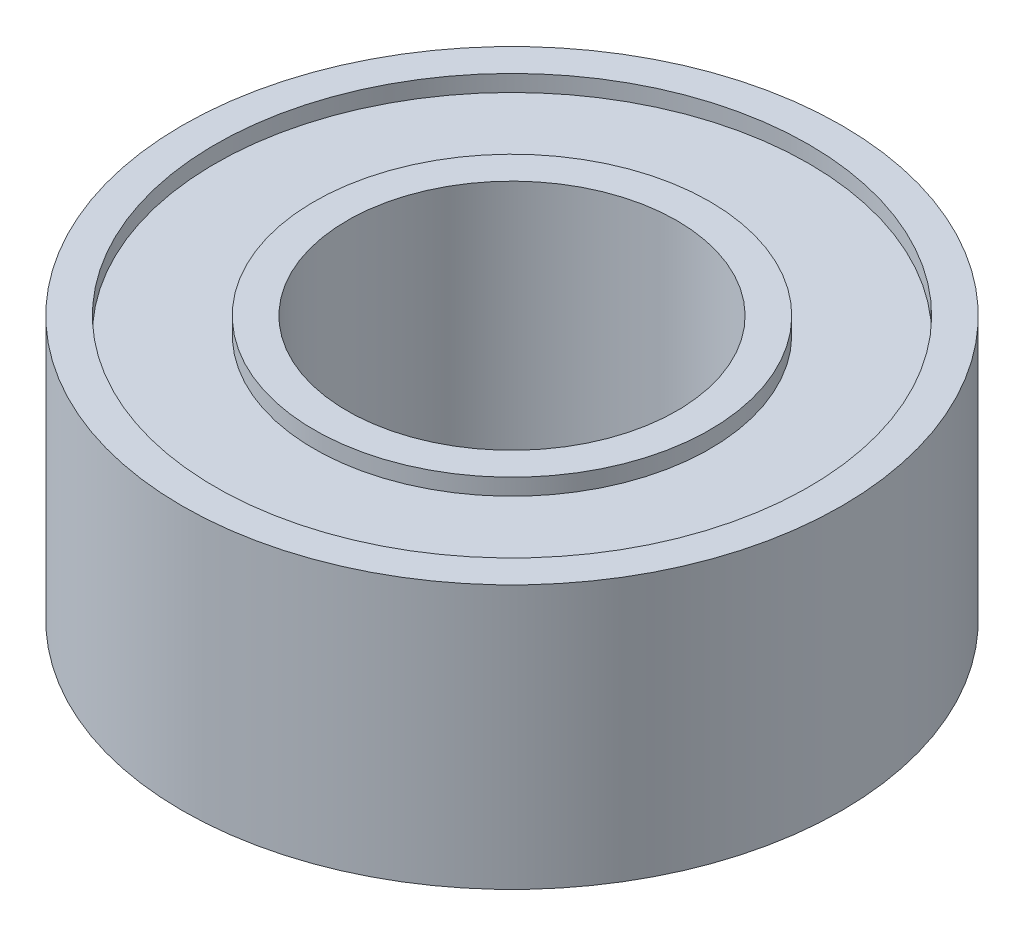
ISO-10303-21;
HEADER;
FILE_DESCRIPTION(('STEP AP214'),'2;1');
FILE_NAME('part.step','',(''),(''),'','','');
FILE_SCHEMA(('AUTOMOTIVE_DESIGN { 1 0 10303 214 1 1 1 1 }'));
ENDSEC;
DATA;
#1=APPLICATION_CONTEXT('core data for automotive mechanical design processes');
#2=APPLICATION_PROTOCOL_DEFINITION('international standard','automotive_design',2000,#1);
#3=PRODUCT_CONTEXT('',#1,'mechanical');
#4=PRODUCT('Part','Part','',(#3));
#5=PRODUCT_RELATED_PRODUCT_CATEGORY('part','',(#4));
#6=PRODUCT_DEFINITION_FORMATION('','',#4);
#7=PRODUCT_DEFINITION_CONTEXT('part definition',#1,'design');
#8=PRODUCT_DEFINITION('design','',#6,#7);
#9=PRODUCT_DEFINITION_SHAPE('','',#8);
#10=(LENGTH_UNIT() NAMED_UNIT(*) SI_UNIT(.MILLI.,.METRE.));
#11=(NAMED_UNIT(*) PLANE_ANGLE_UNIT() SI_UNIT($,.RADIAN.));
#12=(NAMED_UNIT(*) SI_UNIT($,.STERADIAN.) SOLID_ANGLE_UNIT());
#13=UNCERTAINTY_MEASURE_WITH_UNIT(LENGTH_MEASURE(1.E-05),#10,'distance_accuracy_value','');
#14=(GEOMETRIC_REPRESENTATION_CONTEXT(3) GLOBAL_UNCERTAINTY_ASSIGNED_CONTEXT((#13)) GLOBAL_UNIT_ASSIGNED_CONTEXT((#10,
#11,#12)) REPRESENTATION_CONTEXT('',''));
#15=CARTESIAN_POINT('',(0.,0.,0.));
#16=DIRECTION('',(0.,0.,1.));
#17=DIRECTION('',(1.,0.,0.));
#18=AXIS2_PLACEMENT_3D('',#15,#16,#17);
#19=CARTESIAN_POINT('',(0.,-2.,0.));
#20=DIRECTION('',(0.,1.,0.));
#21=DIRECTION('',(0.,0.,-1.));
#22=AXIS2_PLACEMENT_3D('',#19,#20,#21);
#23=PLANE('',#22);
#24=CARTESIAN_POINT('',(0.,-2.,0.));
#25=DIRECTION('',(0.,-1.,0.));
#26=DIRECTION('',(0.,0.,-1.));
#27=AXIS2_PLACEMENT_3D('',#24,#25,#26);
#28=CIRCLE('',#27,2.5);
#29=CARTESIAN_POINT('',(0.,-2.,-2.5));
#30=VERTEX_POINT('',#29);
#31=EDGE_CURVE('E48',#30,#30,#28,.T.);
#32=ORIENTED_EDGE('',*,*,#31,.F.);
#33=EDGE_LOOP('',(#32));
#34=FACE_BOUND('',#33,.T.);
#35=CARTESIAN_POINT('',(0.,-2.,0.));
#36=DIRECTION('',(0.,-1.,0.));
#37=DIRECTION('',(0.,0.,-1.));
#38=AXIS2_PLACEMENT_3D('',#35,#36,#37);
#39=CIRCLE('',#38,3.);
#40=CARTESIAN_POINT('',(0.,-2.,-3.));
#41=VERTEX_POINT('',#40);
#42=EDGE_CURVE('E72',#41,#41,#39,.T.);
#43=ORIENTED_EDGE('',*,*,#42,.T.);
#44=EDGE_LOOP('',(#43));
#45=FACE_BOUND('',#44,.T.);
#46=ADVANCED_FACE('F35',(#34,#45),#23,.F.);
#47=CARTESIAN_POINT('',(0.,2.,0.));
#48=DIRECTION('',(0.,1.,0.));
#49=DIRECTION('',(0.,0.,-1.));
#50=AXIS2_PLACEMENT_3D('',#47,#48,#49);
#51=PLANE('',#50);
#52=CARTESIAN_POINT('',(0.,2.,0.));
#53=DIRECTION('',(0.,-1.,0.));
#54=DIRECTION('',(0.,0.,-1.));
#55=AXIS2_PLACEMENT_3D('',#52,#53,#54);
#56=CIRCLE('',#55,2.5);
#57=CARTESIAN_POINT('',(0.,2.,-2.5));
#58=VERTEX_POINT('',#57);
#59=EDGE_CURVE('E46',#58,#58,#56,.T.);
#60=ORIENTED_EDGE('',*,*,#59,.T.);
#61=EDGE_LOOP('',(#60));
#62=FACE_BOUND('',#61,.T.);
#63=CARTESIAN_POINT('',(0.,2.,0.));
#64=DIRECTION('',(0.,-1.,0.));
#65=DIRECTION('',(0.,0.,-1.));
#66=AXIS2_PLACEMENT_3D('',#63,#64,#65);
#67=CIRCLE('',#66,3.);
#68=CARTESIAN_POINT('',(0.,2.,-3.));
#69=VERTEX_POINT('',#68);
#70=EDGE_CURVE('E60',#69,#69,#67,.T.);
#71=ORIENTED_EDGE('',*,*,#70,.F.);
#72=EDGE_LOOP('',(#71));
#73=FACE_BOUND('',#72,.T.);
#74=ADVANCED_FACE('F98',(#62,#73),#51,.T.);
#75=CARTESIAN_POINT('',(0.,2.,0.));
#76=DIRECTION('',(0.,-1.,0.));
#77=DIRECTION('',(0.,0.,-1.));
#78=AXIS2_PLACEMENT_3D('',#75,#76,#77);
#79=CIRCLE('',#78,4.5);
#80=CARTESIAN_POINT('',(0.,2.,-4.5));
#81=VERTEX_POINT('',#80);
#82=EDGE_CURVE('E54',#81,#81,#79,.T.);
#83=ORIENTED_EDGE('',*,*,#82,.T.);
#84=EDGE_LOOP('',(#83));
#85=FACE_BOUND('',#84,.T.);
#86=CARTESIAN_POINT('',(0.,2.,0.));
#87=DIRECTION('',(0.,-1.,0.));
#88=DIRECTION('',(0.,0.,-1.));
#89=AXIS2_PLACEMENT_3D('',#86,#87,#88);
#90=CIRCLE('',#89,5.);
#91=CARTESIAN_POINT('',(0.,2.,-5.));
#92=VERTEX_POINT('',#91);
#93=EDGE_CURVE('E10',#92,#92,#90,.T.);
#94=ORIENTED_EDGE('',*,*,#93,.F.);
#95=EDGE_LOOP('',(#94));
#96=FACE_BOUND('',#95,.T.);
#97=ADVANCED_FACE('F104',(#85,#96),#51,.T.);
#98=CARTESIAN_POINT('',(0.,-2.,0.));
#99=DIRECTION('',(0.,-1.,0.));
#100=DIRECTION('',(0.,0.,-1.));
#101=AXIS2_PLACEMENT_3D('',#98,#99,#100);
#102=CIRCLE('',#101,4.5);
#103=CARTESIAN_POINT('',(0.,-2.,-4.5));
#104=VERTEX_POINT('',#103);
#105=EDGE_CURVE('E66',#104,#104,#102,.T.);
#106=ORIENTED_EDGE('',*,*,#105,.F.);
#107=EDGE_LOOP('',(#106));
#108=FACE_BOUND('',#107,.T.);
#109=CARTESIAN_POINT('',(0.,-2.,0.));
#110=DIRECTION('',(0.,-1.,0.));
#111=DIRECTION('',(0.,0.,-1.));
#112=AXIS2_PLACEMENT_3D('',#109,#110,#111);
#113=CIRCLE('',#112,5.);
#114=CARTESIAN_POINT('',(0.,-2.,-5.));
#115=VERTEX_POINT('',#114);
#116=EDGE_CURVE('E39',#115,#115,#113,.T.);
#117=ORIENTED_EDGE('',*,*,#116,.T.);
#118=EDGE_LOOP('',(#117));
#119=FACE_BOUND('',#118,.T.);
#120=ADVANCED_FACE('F100',(#108,#119),#23,.F.);
#121=CARTESIAN_POINT('',(0.,2.,0.));
#122=DIRECTION('',(0.,-1.,0.));
#123=DIRECTION('',(0.,0.,1.));
#124=AXIS2_PLACEMENT_3D('',#121,#122,#123);
#125=CYLINDRICAL_SURFACE('',#124,5.);
#126=ORIENTED_EDGE('',*,*,#93,.T.);
#127=EDGE_LOOP('',(#126));
#128=FACE_BOUND('',#127,.T.);
#129=ORIENTED_EDGE('',*,*,#116,.F.);
#130=EDGE_LOOP('',(#129));
#131=FACE_BOUND('',#130,.T.);
#132=ADVANCED_FACE('F37',(#128,#131),#125,.T.);
#133=CARTESIAN_POINT('',(0.,2.,0.));
#134=DIRECTION('',(0.,-1.,0.));
#135=DIRECTION('',(0.,0.,1.));
#136=AXIS2_PLACEMENT_3D('',#133,#134,#135);
#137=CYLINDRICAL_SURFACE('',#136,2.5);
#138=ORIENTED_EDGE('',*,*,#59,.F.);
#139=EDGE_LOOP('',(#138));
#140=FACE_BOUND('',#139,.T.);
#141=ORIENTED_EDGE('',*,*,#31,.T.);
#142=EDGE_LOOP('',(#141));
#143=FACE_BOUND('',#142,.T.);
#144=ADVANCED_FACE('F115',(#140,#143),#137,.F.);
#145=CARTESIAN_POINT('',(0.,1.75,0.));
#146=DIRECTION('',(0.,1.,0.));
#147=DIRECTION('',(0.,0.,-1.));
#148=AXIS2_PLACEMENT_3D('',#145,#146,#147);
#149=CYLINDRICAL_SURFACE('',#148,4.5);
#150=CARTESIAN_POINT('',(0.,1.75,0.));
#151=DIRECTION('',(0.,-1.,0.));
#152=DIRECTION('',(0.,0.,-1.));
#153=AXIS2_PLACEMENT_3D('',#150,#151,#152);
#154=CIRCLE('',#153,4.5);
#155=CARTESIAN_POINT('',(0.,1.75,-4.5));
#156=VERTEX_POINT('',#155);
#157=EDGE_CURVE('E51',#156,#156,#154,.T.);
#158=ORIENTED_EDGE('',*,*,#157,.T.);
#159=EDGE_LOOP('',(#158));
#160=FACE_BOUND('',#159,.T.);
#161=ORIENTED_EDGE('',*,*,#82,.F.);
#162=EDGE_LOOP('',(#161));
#163=FACE_BOUND('',#162,.T.);
#164=ADVANCED_FACE('F128',(#160,#163),#149,.F.);
#165=CARTESIAN_POINT('',(0.,1.75,0.));
#166=DIRECTION('',(0.,1.,0.));
#167=DIRECTION('',(0.,0.,-1.));
#168=AXIS2_PLACEMENT_3D('',#165,#166,#167);
#169=PLANE('',#168);
#170=CARTESIAN_POINT('',(0.,1.75,0.));
#171=DIRECTION('',(0.,-1.,0.));
#172=DIRECTION('',(0.,0.,-1.));
#173=AXIS2_PLACEMENT_3D('',#170,#171,#172);
#174=CIRCLE('',#173,3.);
#175=CARTESIAN_POINT('',(0.,1.75,-3.));
#176=VERTEX_POINT('',#175);
#177=EDGE_CURVE('E57',#176,#176,#174,.T.);
#178=ORIENTED_EDGE('',*,*,#177,.T.);
#179=EDGE_LOOP('',(#178));
#180=FACE_BOUND('',#179,.T.);
#181=ORIENTED_EDGE('',*,*,#157,.F.);
#182=EDGE_LOOP('',(#181));
#183=FACE_BOUND('',#182,.T.);
#184=ADVANCED_FACE('F93',(#180,#183),#169,.T.);
#185=CARTESIAN_POINT('',(0.,1.75,0.));
#186=DIRECTION('',(0.,1.,0.));
#187=DIRECTION('',(0.,0.,-1.));
#188=AXIS2_PLACEMENT_3D('',#185,#186,#187);
#189=CYLINDRICAL_SURFACE('',#188,3.);
#190=ORIENTED_EDGE('',*,*,#177,.F.);
#191=EDGE_LOOP('',(#190));
#192=FACE_BOUND('',#191,.T.);
#193=ORIENTED_EDGE('',*,*,#70,.T.);
#194=EDGE_LOOP('',(#193));
#195=FACE_BOUND('',#194,.T.);
#196=ADVANCED_FACE('F84',(#192,#195),#189,.T.);
#197=CARTESIAN_POINT('',(0.,-1.75,0.));
#198=DIRECTION('',(0.,-1.,0.));
#199=DIRECTION('',(0.,0.,-1.));
#200=AXIS2_PLACEMENT_3D('',#197,#198,#199);
#201=PLANE('',#200);
#202=CARTESIAN_POINT('',(0.,-1.75,0.));
#203=DIRECTION('',(0.,-1.,0.));
#204=DIRECTION('',(0.,0.,-1.));
#205=AXIS2_PLACEMENT_3D('',#202,#203,#204);
#206=CIRCLE('',#205,4.5);
#207=CARTESIAN_POINT('',(0.,-1.75,-4.5));
#208=VERTEX_POINT('',#207);
#209=EDGE_CURVE('E63',#208,#208,#206,.T.);
#210=ORIENTED_EDGE('',*,*,#209,.T.);
#211=EDGE_LOOP('',(#210));
#212=FACE_BOUND('',#211,.T.);
#213=CARTESIAN_POINT('',(0.,-1.75,0.));
#214=DIRECTION('',(0.,-1.,0.));
#215=DIRECTION('',(0.,0.,-1.));
#216=AXIS2_PLACEMENT_3D('',#213,#214,#215);
#217=CIRCLE('',#216,3.);
#218=CARTESIAN_POINT('',(0.,-1.75,-3.));
#219=VERTEX_POINT('',#218);
#220=EDGE_CURVE('E69',#219,#219,#217,.T.);
#221=ORIENTED_EDGE('',*,*,#220,.F.);
#222=EDGE_LOOP('',(#221));
#223=FACE_BOUND('',#222,.T.);
#224=ADVANCED_FACE('F81',(#212,#223),#201,.T.);
#225=CARTESIAN_POINT('',(0.,-1.75,0.));
#226=DIRECTION('',(0.,-1.,0.));
#227=DIRECTION('',(0.,0.,1.));
#228=AXIS2_PLACEMENT_3D('',#225,#226,#227);
#229=CYLINDRICAL_SURFACE('',#228,4.5);
#230=ORIENTED_EDGE('',*,*,#209,.F.);
#231=EDGE_LOOP('',(#230));
#232=FACE_BOUND('',#231,.T.);
#233=ORIENTED_EDGE('',*,*,#105,.T.);
#234=EDGE_LOOP('',(#233));
#235=FACE_BOUND('',#234,.T.);
#236=ADVANCED_FACE('F83',(#232,#235),#229,.F.);
#237=CARTESIAN_POINT('',(0.,-1.75,0.));
#238=DIRECTION('',(0.,-1.,0.));
#239=DIRECTION('',(0.,0.,1.));
#240=AXIS2_PLACEMENT_3D('',#237,#238,#239);
#241=CYLINDRICAL_SURFACE('',#240,3.);
#242=ORIENTED_EDGE('',*,*,#220,.T.);
#243=EDGE_LOOP('',(#242));
#244=FACE_BOUND('',#243,.T.);
#245=ORIENTED_EDGE('',*,*,#42,.F.);
#246=EDGE_LOOP('',(#245));
#247=FACE_BOUND('',#246,.T.);
#248=ADVANCED_FACE('F78',(#244,#247),#241,.T.);
#249=CLOSED_SHELL('',(#46,#74,#97,#120,#132,#144,#164,#184,#196,#224,#236,#248));
#250=MANIFOLD_SOLID_BREP('B2',#249);
#251=ADVANCED_BREP_SHAPE_REPRESENTATION('',(#18,#250),#14);
#252=SHAPE_DEFINITION_REPRESENTATION(#9,#251);
ENDSEC;
END-ISO-10303-21;
